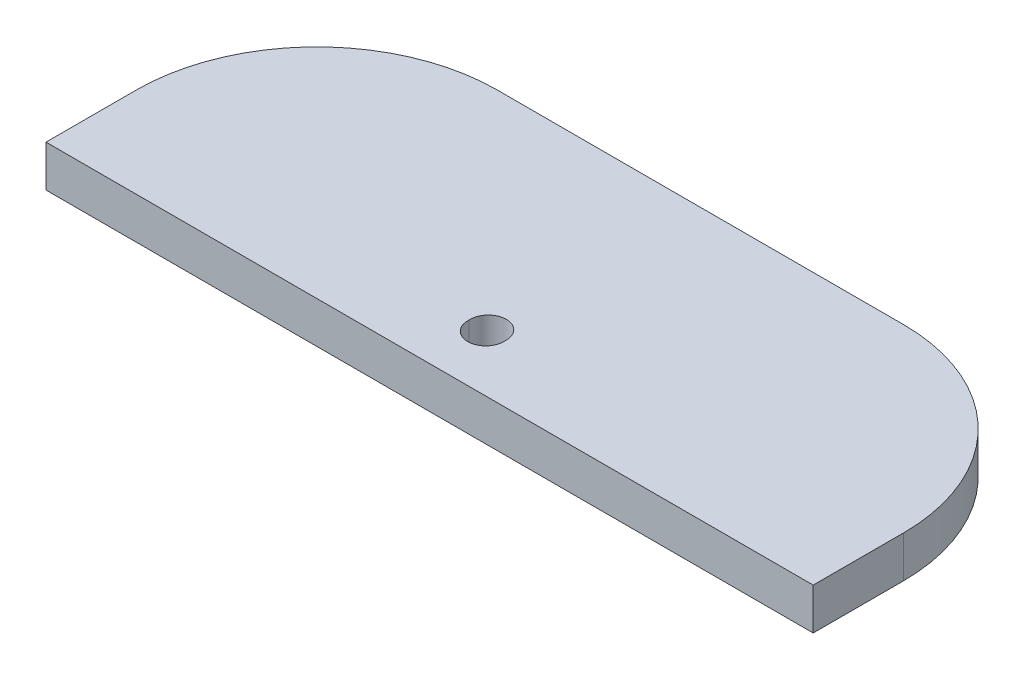
ISO-10303-21;
HEADER;
FILE_DESCRIPTION(('STEP AP214'),'2;1');
FILE_NAME('part.step','',(''),(''),'','','');
FILE_SCHEMA(('AUTOMOTIVE_DESIGN { 1 0 10303 214 1 1 1 1 }'));
ENDSEC;
DATA;
#1=APPLICATION_CONTEXT('core data for automotive mechanical design processes');
#2=APPLICATION_PROTOCOL_DEFINITION('international standard','automotive_design',2000,#1);
#3=PRODUCT_CONTEXT('',#1,'mechanical');
#4=PRODUCT('Part','Part','',(#3));
#5=PRODUCT_RELATED_PRODUCT_CATEGORY('part','',(#4));
#6=PRODUCT_DEFINITION_FORMATION('','',#4);
#7=PRODUCT_DEFINITION_CONTEXT('part definition',#1,'design');
#8=PRODUCT_DEFINITION('design','',#6,#7);
#9=PRODUCT_DEFINITION_SHAPE('','',#8);
#10=(LENGTH_UNIT() NAMED_UNIT(*) SI_UNIT(.MILLI.,.METRE.));
#11=(NAMED_UNIT(*) PLANE_ANGLE_UNIT() SI_UNIT($,.RADIAN.));
#12=(NAMED_UNIT(*) SI_UNIT($,.STERADIAN.) SOLID_ANGLE_UNIT());
#13=UNCERTAINTY_MEASURE_WITH_UNIT(LENGTH_MEASURE(1.E-05),#10,'distance_accuracy_value','');
#14=(GEOMETRIC_REPRESENTATION_CONTEXT(3) GLOBAL_UNCERTAINTY_ASSIGNED_CONTEXT((#13)) GLOBAL_UNIT_ASSIGNED_CONTEXT((#10,
#11,#12)) REPRESENTATION_CONTEXT('',''));
#15=CARTESIAN_POINT('',(0.,0.,0.));
#16=DIRECTION('',(0.,0.,1.));
#17=DIRECTION('',(1.,0.,0.));
#18=AXIS2_PLACEMENT_3D('',#15,#16,#17);
#19=CARTESIAN_POINT('',(0.,2.3,0.));
#20=DIRECTION('',(0.,1.,0.));
#21=DIRECTION('',(0.,0.,1.));
#22=AXIS2_PLACEMENT_3D('',#19,#20,#21);
#23=PLANE('',#22);
#24=CARTESIAN_POINT('',(0.,2.3,4.38867808269156));
#25=DIRECTION('',(0.,1.,0.));
#26=DIRECTION('',(0.,0.,1.));
#27=AXIS2_PLACEMENT_3D('',#24,#25,#26);
#28=CIRCLE('',#27,1.);
#29=CARTESIAN_POINT('',(-0.997593152214493,2.3,4.31933904134578));
#30=VERTEX_POINT('',#29);
#31=CARTESIAN_POINT('',(0.997593152214493,2.3,4.31933904134578));
#32=VERTEX_POINT('',#31);
#33=EDGE_CURVE('E77',#30,#32,#28,.T.);
#34=ORIENTED_EDGE('',*,*,#33,.F.);
#35=CARTESIAN_POINT('',(0.,2.3,4.25));
#36=DIRECTION('',(0.,1.,0.));
#37=DIRECTION('',(0.,0.,1.));
#38=AXIS2_PLACEMENT_3D('',#35,#36,#37);
#39=CIRCLE('',#38,1.);
#40=EDGE_CURVE('E135',#32,#30,#39,.T.);
#41=ORIENTED_EDGE('',*,*,#40,.F.);
#42=EDGE_LOOP('',(#34,#41));
#43=FACE_BOUND('',#42,.T.);
#44=DIRECTION('',(0.,0.,-1.));
#45=VECTOR('',#44,1.);
#46=CARTESIAN_POINT('',(21.25,2.3,-7.5));
#47=LINE('',#46,#45);
#48=CARTESIAN_POINT('',(21.25,2.3,7.5));
#49=VERTEX_POINT('',#48);
#50=CARTESIAN_POINT('',(21.25,2.3,2.5));
#51=VERTEX_POINT('',#50);
#52=EDGE_CURVE('E147',#49,#51,#47,.T.);
#53=ORIENTED_EDGE('',*,*,#52,.T.);
#54=CARTESIAN_POINT('',(11.25,2.3,2.5));
#55=DIRECTION('',(0.,1.,0.));
#56=DIRECTION('',(0.,0.,1.));
#57=AXIS2_PLACEMENT_3D('',#54,#55,#56);
#58=CIRCLE('',#57,10.);
#59=CARTESIAN_POINT('',(11.25,2.3,-7.5));
#60=VERTEX_POINT('',#59);
#61=EDGE_CURVE('E180',#51,#60,#58,.T.);
#62=ORIENTED_EDGE('',*,*,#61,.T.);
#63=DIRECTION('',(-1.,0.,0.));
#64=VECTOR('',#63,1.);
#65=CARTESIAN_POINT('',(-21.25,2.3,-7.5));
#66=LINE('',#65,#64);
#67=CARTESIAN_POINT('',(-11.25,2.3,-7.5));
#68=VERTEX_POINT('',#67);
#69=EDGE_CURVE('E150',#60,#68,#66,.T.);
#70=ORIENTED_EDGE('',*,*,#69,.T.);
#71=CARTESIAN_POINT('',(-11.25,2.3,2.5));
#72=DIRECTION('',(0.,1.,0.));
#73=DIRECTION('',(0.,0.,1.));
#74=AXIS2_PLACEMENT_3D('',#71,#72,#73);
#75=CIRCLE('',#74,10.);
#76=CARTESIAN_POINT('',(-21.25,2.3,2.5));
#77=VERTEX_POINT('',#76);
#78=EDGE_CURVE('E85',#68,#77,#75,.T.);
#79=ORIENTED_EDGE('',*,*,#78,.T.);
#80=DIRECTION('',(0.,0.,1.));
#81=VECTOR('',#80,1.);
#82=CARTESIAN_POINT('',(-21.25,2.3,-7.5));
#83=LINE('',#82,#81);
#84=CARTESIAN_POINT('',(-21.25,2.3,7.5));
#85=VERTEX_POINT('',#84);
#86=EDGE_CURVE('E153',#77,#85,#83,.T.);
#87=ORIENTED_EDGE('',*,*,#86,.T.);
#88=DIRECTION('',(1.,0.,0.));
#89=VECTOR('',#88,1.);
#90=CARTESIAN_POINT('',(-21.25,2.3,7.5));
#91=LINE('',#90,#89);
#92=EDGE_CURVE('E155',#85,#49,#91,.T.);
#93=ORIENTED_EDGE('',*,*,#92,.T.);
#94=EDGE_LOOP('',(#53,#62,#70,#79,#87,#93));
#95=FACE_BOUND('',#94,.T.);
#96=ADVANCED_FACE('F63',(#43,#95),#23,.T.);
#97=CARTESIAN_POINT('',(0.,0.,0.));
#98=DIRECTION('',(0.,1.,0.));
#99=DIRECTION('',(0.,0.,1.));
#100=AXIS2_PLACEMENT_3D('',#97,#98,#99);
#101=PLANE('',#100);
#102=DIRECTION('',(-1.,0.,0.));
#103=VECTOR('',#102,1.);
#104=CARTESIAN_POINT('',(-21.25,0.,-7.5));
#105=LINE('',#104,#103);
#106=CARTESIAN_POINT('',(11.25,0.,-7.5));
#107=VERTEX_POINT('',#106);
#108=CARTESIAN_POINT('',(-11.25,0.,-7.5));
#109=VERTEX_POINT('',#108);
#110=EDGE_CURVE('E142',#107,#109,#105,.T.);
#111=ORIENTED_EDGE('',*,*,#110,.F.);
#112=CARTESIAN_POINT('',(11.25,0.,2.5));
#113=DIRECTION('',(0.,1.,0.));
#114=DIRECTION('',(0.,0.,1.));
#115=AXIS2_PLACEMENT_3D('',#112,#113,#114);
#116=CIRCLE('',#115,10.);
#117=CARTESIAN_POINT('',(21.25,0.,2.5));
#118=VERTEX_POINT('',#117);
#119=EDGE_CURVE('E175',#107,#118,#116,.F.);
#120=ORIENTED_EDGE('',*,*,#119,.T.);
#121=DIRECTION('',(0.,0.,-1.));
#122=VECTOR('',#121,1.);
#123=CARTESIAN_POINT('',(21.25,0.,-7.5));
#124=LINE('',#123,#122);
#125=CARTESIAN_POINT('',(21.25,0.,7.5));
#126=VERTEX_POINT('',#125);
#127=EDGE_CURVE('E138',#126,#118,#124,.T.);
#128=ORIENTED_EDGE('',*,*,#127,.F.);
#129=DIRECTION('',(1.,0.,0.));
#130=VECTOR('',#129,1.);
#131=CARTESIAN_POINT('',(-21.25,0.,7.5));
#132=LINE('',#131,#130);
#133=CARTESIAN_POINT('',(-21.25,0.,7.5));
#134=VERTEX_POINT('',#133);
#135=EDGE_CURVE('E151',#134,#126,#132,.T.);
#136=ORIENTED_EDGE('',*,*,#135,.F.);
#137=DIRECTION('',(0.,0.,1.));
#138=VECTOR('',#137,1.);
#139=CARTESIAN_POINT('',(-21.25,0.,-7.5));
#140=LINE('',#139,#138);
#141=CARTESIAN_POINT('',(-21.25,0.,2.5));
#142=VERTEX_POINT('',#141);
#143=EDGE_CURVE('E160',#142,#134,#140,.T.);
#144=ORIENTED_EDGE('',*,*,#143,.F.);
#145=CARTESIAN_POINT('',(-11.25,0.,2.5));
#146=DIRECTION('',(0.,1.,0.));
#147=DIRECTION('',(0.,0.,1.));
#148=AXIS2_PLACEMENT_3D('',#145,#146,#147);
#149=CIRCLE('',#148,10.);
#150=EDGE_CURVE('E173',#142,#109,#149,.F.);
#151=ORIENTED_EDGE('',*,*,#150,.T.);
#152=EDGE_LOOP('',(#111,#120,#128,#136,#144,#151));
#153=FACE_BOUND('',#152,.T.);
#154=CARTESIAN_POINT('',(0.,0.,4.25));
#155=DIRECTION('',(0.,1.,0.));
#156=DIRECTION('',(0.,0.,1.));
#157=AXIS2_PLACEMENT_3D('',#154,#155,#156);
#158=CIRCLE('',#157,1.);
#159=CARTESIAN_POINT('',(0.997593152214493,0.,4.31933904134578));
#160=VERTEX_POINT('',#159);
#161=CARTESIAN_POINT('',(-0.997593152214493,0.,4.31933904134578));
#162=VERTEX_POINT('',#161);
#163=EDGE_CURVE('E139',#160,#162,#158,.T.);
#164=ORIENTED_EDGE('',*,*,#163,.T.);
#165=CARTESIAN_POINT('',(0.,0.,4.38867808269156));
#166=DIRECTION('',(0.,1.,0.));
#167=DIRECTION('',(0.,0.,1.));
#168=AXIS2_PLACEMENT_3D('',#165,#166,#167);
#169=CIRCLE('',#168,1.);
#170=EDGE_CURVE('E128',#162,#160,#169,.T.);
#171=ORIENTED_EDGE('',*,*,#170,.T.);
#172=EDGE_LOOP('',(#164,#171));
#173=FACE_BOUND('',#172,.T.);
#174=ADVANCED_FACE('F185',(#153,#173),#101,.F.);
#175=CARTESIAN_POINT('',(21.25,2.3,-7.5));
#176=DIRECTION('',(-1.,0.,0.));
#177=DIRECTION('',(0.,0.,1.));
#178=AXIS2_PLACEMENT_3D('',#175,#176,#177);
#179=PLANE('',#178);
#180=ORIENTED_EDGE('',*,*,#127,.T.);
#181=DIRECTION('',(0.,-1.,0.));
#182=VECTOR('',#181,1.);
#183=CARTESIAN_POINT('',(21.25,2.3,2.5));
#184=LINE('',#183,#182);
#185=EDGE_CURVE('E177',#118,#51,#184,.F.);
#186=ORIENTED_EDGE('',*,*,#185,.T.);
#187=ORIENTED_EDGE('',*,*,#52,.F.);
#188=DIRECTION('',(0.,-1.,0.));
#189=VECTOR('',#188,1.);
#190=CARTESIAN_POINT('',(21.25,2.3,7.5));
#191=LINE('',#190,#189);
#192=EDGE_CURVE('E156',#49,#126,#191,.T.);
#193=ORIENTED_EDGE('',*,*,#192,.T.);
#194=EDGE_LOOP('',(#180,#186,#187,#193));
#195=FACE_BOUND('',#194,.T.);
#196=ADVANCED_FACE('F187',(#195),#179,.F.);
#197=CARTESIAN_POINT('',(-21.25,2.3,-7.5));
#198=DIRECTION('',(0.,0.,1.));
#199=DIRECTION('',(1.,0.,0.));
#200=AXIS2_PLACEMENT_3D('',#197,#198,#199);
#201=PLANE('',#200);
#202=ORIENTED_EDGE('',*,*,#69,.F.);
#203=DIRECTION('',(0.,-1.,0.));
#204=VECTOR('',#203,1.);
#205=CARTESIAN_POINT('',(11.25,2.3,-7.5));
#206=LINE('',#205,#204);
#207=EDGE_CURVE('E170',#60,#107,#206,.T.);
#208=ORIENTED_EDGE('',*,*,#207,.T.);
#209=ORIENTED_EDGE('',*,*,#110,.T.);
#210=DIRECTION('',(0.,-1.,0.));
#211=VECTOR('',#210,1.);
#212=CARTESIAN_POINT('',(-11.25,2.3,-7.5));
#213=LINE('',#212,#211);
#214=EDGE_CURVE('E168',#109,#68,#213,.F.);
#215=ORIENTED_EDGE('',*,*,#214,.T.);
#216=EDGE_LOOP('',(#202,#208,#209,#215));
#217=FACE_BOUND('',#216,.T.);
#218=ADVANCED_FACE('F195',(#217),#201,.F.);
#219=CARTESIAN_POINT('',(-21.25,2.3,-7.5));
#220=DIRECTION('',(1.,0.,0.));
#221=DIRECTION('',(0.,0.,-1.));
#222=AXIS2_PLACEMENT_3D('',#219,#220,#221);
#223=PLANE('',#222);
#224=ORIENTED_EDGE('',*,*,#86,.F.);
#225=DIRECTION('',(0.,-1.,0.));
#226=VECTOR('',#225,1.);
#227=CARTESIAN_POINT('',(-21.25,2.3,2.5));
#228=LINE('',#227,#226);
#229=EDGE_CURVE('E182',#77,#142,#228,.T.);
#230=ORIENTED_EDGE('',*,*,#229,.T.);
#231=ORIENTED_EDGE('',*,*,#143,.T.);
#232=DIRECTION('',(0.,-1.,0.));
#233=VECTOR('',#232,1.);
#234=CARTESIAN_POINT('',(-21.25,2.3,7.5));
#235=LINE('',#234,#233);
#236=EDGE_CURVE('E165',#85,#134,#235,.T.);
#237=ORIENTED_EDGE('',*,*,#236,.F.);
#238=EDGE_LOOP('',(#224,#230,#231,#237));
#239=FACE_BOUND('',#238,.T.);
#240=ADVANCED_FACE('F205',(#239),#223,.F.);
#241=CARTESIAN_POINT('',(-21.25,2.3,7.5));
#242=DIRECTION('',(0.,0.,-1.));
#243=DIRECTION('',(-1.,0.,0.));
#244=AXIS2_PLACEMENT_3D('',#241,#242,#243);
#245=PLANE('',#244);
#246=ORIENTED_EDGE('',*,*,#135,.T.);
#247=ORIENTED_EDGE('',*,*,#192,.F.);
#248=ORIENTED_EDGE('',*,*,#92,.F.);
#249=ORIENTED_EDGE('',*,*,#236,.T.);
#250=EDGE_LOOP('',(#246,#247,#248,#249));
#251=FACE_BOUND('',#250,.T.);
#252=ADVANCED_FACE('F202',(#251),#245,.F.);
#253=CARTESIAN_POINT('',(0.,2.3,4.25));
#254=DIRECTION('',(0.,-1.,0.));
#255=DIRECTION('',(0.,0.,-1.));
#256=AXIS2_PLACEMENT_3D('',#253,#254,#255);
#257=CYLINDRICAL_SURFACE('',#256,1.);
#258=DIRECTION('',(0.,1.,0.));
#259=VECTOR('',#258,1.);
#260=CARTESIAN_POINT('',(-0.997593152214493,1.15,4.31933904134578));
#261=LINE('',#260,#259);
#262=EDGE_CURVE('E12',#162,#30,#261,.T.);
#263=ORIENTED_EDGE('',*,*,#262,.F.);
#264=ORIENTED_EDGE('',*,*,#163,.F.);
#265=DIRECTION('',(0.,1.,0.));
#266=VECTOR('',#265,1.);
#267=CARTESIAN_POINT('',(0.997593152214493,1.15,4.31933904134578));
#268=LINE('',#267,#266);
#269=EDGE_CURVE('E71',#32,#160,#268,.F.);
#270=ORIENTED_EDGE('',*,*,#269,.F.);
#271=ORIENTED_EDGE('',*,*,#40,.T.);
#272=EDGE_LOOP('',(#263,#264,#270,#271));
#273=FACE_BOUND('',#272,.T.);
#274=ADVANCED_FACE('F137',(#273),#257,.F.);
#275=CARTESIAN_POINT('',(11.25,2.3,2.5));
#276=DIRECTION('',(0.,-1.,0.));
#277=DIRECTION('',(0.,0.,-1.));
#278=AXIS2_PLACEMENT_3D('',#275,#276,#277);
#279=CYLINDRICAL_SURFACE('',#278,10.);
#280=ORIENTED_EDGE('',*,*,#61,.F.);
#281=ORIENTED_EDGE('',*,*,#185,.F.);
#282=ORIENTED_EDGE('',*,*,#119,.F.);
#283=ORIENTED_EDGE('',*,*,#207,.F.);
#284=EDGE_LOOP('',(#280,#281,#282,#283));
#285=FACE_BOUND('',#284,.T.);
#286=ADVANCED_FACE('F212',(#285),#279,.T.);
#287=CARTESIAN_POINT('',(-11.25,2.3,2.5));
#288=DIRECTION('',(0.,-1.,0.));
#289=DIRECTION('',(0.,0.,-1.));
#290=AXIS2_PLACEMENT_3D('',#287,#288,#289);
#291=CYLINDRICAL_SURFACE('',#290,10.);
#292=ORIENTED_EDGE('',*,*,#78,.F.);
#293=ORIENTED_EDGE('',*,*,#214,.F.);
#294=ORIENTED_EDGE('',*,*,#150,.F.);
#295=ORIENTED_EDGE('',*,*,#229,.F.);
#296=EDGE_LOOP('',(#292,#293,#294,#295));
#297=FACE_BOUND('',#296,.T.);
#298=ADVANCED_FACE('F65',(#297),#291,.T.);
#299=CARTESIAN_POINT('',(0.,0.,4.38867808269156));
#300=DIRECTION('',(0.,1.,0.));
#301=DIRECTION('',(0.,0.,1.));
#302=AXIS2_PLACEMENT_3D('',#299,#300,#301);
#303=CYLINDRICAL_SURFACE('',#302,1.);
#304=ORIENTED_EDGE('',*,*,#262,.T.);
#305=ORIENTED_EDGE('',*,*,#33,.T.);
#306=ORIENTED_EDGE('',*,*,#269,.T.);
#307=ORIENTED_EDGE('',*,*,#170,.F.);
#308=EDGE_LOOP('',(#304,#305,#306,#307));
#309=FACE_BOUND('',#308,.T.);
#310=ADVANCED_FACE('F126',(#309),#303,.F.);
#311=CLOSED_SHELL('',(#96,#174,#196,#218,#240,#252,#274,#286,#298,#310));
#312=MANIFOLD_SOLID_BREP('B2',#311);
#313=ADVANCED_BREP_SHAPE_REPRESENTATION('',(#18,#312),#14);
#314=SHAPE_DEFINITION_REPRESENTATION(#9,#313);
ENDSEC;
END-ISO-10303-21;
